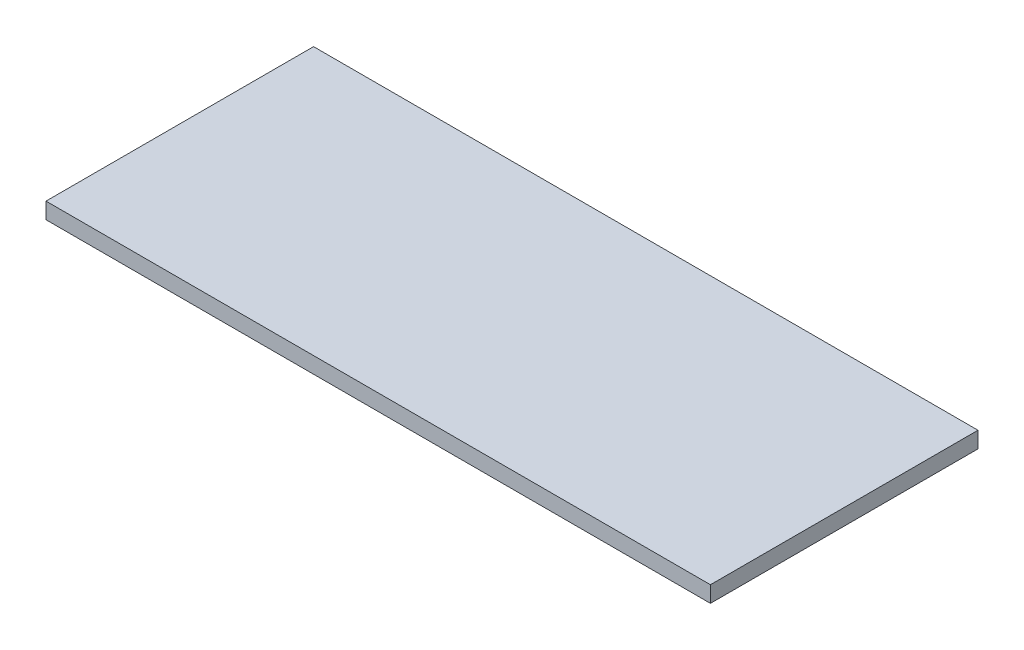
ISO-10303-21;
HEADER;
FILE_DESCRIPTION(('STEP AP214'),'2;1');
FILE_NAME('part.step','',(''),(''),'','','');
FILE_SCHEMA(('AUTOMOTIVE_DESIGN { 1 0 10303 214 1 1 1 1 }'));
ENDSEC;
DATA;
#1=APPLICATION_CONTEXT('core data for automotive mechanical design processes');
#2=APPLICATION_PROTOCOL_DEFINITION('international standard','automotive_design',2000,#1);
#3=PRODUCT_CONTEXT('',#1,'mechanical');
#4=PRODUCT('Part','Part','',(#3));
#5=PRODUCT_RELATED_PRODUCT_CATEGORY('part','',(#4));
#6=PRODUCT_DEFINITION_FORMATION('','',#4);
#7=PRODUCT_DEFINITION_CONTEXT('part definition',#1,'design');
#8=PRODUCT_DEFINITION('design','',#6,#7);
#9=PRODUCT_DEFINITION_SHAPE('','',#8);
#10=(LENGTH_UNIT() NAMED_UNIT(*) SI_UNIT(.MILLI.,.METRE.));
#11=(NAMED_UNIT(*) PLANE_ANGLE_UNIT() SI_UNIT($,.RADIAN.));
#12=(NAMED_UNIT(*) SI_UNIT($,.STERADIAN.) SOLID_ANGLE_UNIT());
#13=UNCERTAINTY_MEASURE_WITH_UNIT(LENGTH_MEASURE(1.E-05),#10,'distance_accuracy_value','');
#14=(GEOMETRIC_REPRESENTATION_CONTEXT(3) GLOBAL_UNCERTAINTY_ASSIGNED_CONTEXT((#13)) GLOBAL_UNIT_ASSIGNED_CONTEXT((#10,
#11,#12)) REPRESENTATION_CONTEXT('',''));
#15=CARTESIAN_POINT('',(0.,0.,0.));
#16=DIRECTION('',(0.,0.,1.));
#17=DIRECTION('',(1.,0.,0.));
#18=AXIS2_PLACEMENT_3D('',#15,#16,#17);
#19=CARTESIAN_POINT('',(-370.,18.,149.));
#20=DIRECTION('',(1.,0.,0.));
#21=DIRECTION('',(0.,0.,-1.));
#22=AXIS2_PLACEMENT_3D('',#19,#20,#21);
#23=PLANE('',#22);
#24=DIRECTION('',(0.,0.,1.));
#25=VECTOR('',#24,1.);
#26=CARTESIAN_POINT('',(-370.,0.,149.));
#27=LINE('',#26,#25);
#28=CARTESIAN_POINT('',(-370.,0.,-149.));
#29=VERTEX_POINT('',#28);
#30=CARTESIAN_POINT('',(-370.,0.,149.));
#31=VERTEX_POINT('',#30);
#32=EDGE_CURVE('E98',#29,#31,#27,.T.);
#33=ORIENTED_EDGE('',*,*,#32,.T.);
#34=DIRECTION('',(0.,-1.,0.));
#35=VECTOR('',#34,1.);
#36=CARTESIAN_POINT('',(-370.,18.,149.));
#37=LINE('',#36,#35);
#38=CARTESIAN_POINT('',(-370.,18.,149.));
#39=VERTEX_POINT('',#38);
#40=EDGE_CURVE('E11',#39,#31,#37,.T.);
#41=ORIENTED_EDGE('',*,*,#40,.F.);
#42=DIRECTION('',(0.,0.,1.));
#43=VECTOR('',#42,1.);
#44=CARTESIAN_POINT('',(-370.,18.,149.));
#45=LINE('',#44,#43);
#46=CARTESIAN_POINT('',(-370.,18.,-149.));
#47=VERTEX_POINT('',#46);
#48=EDGE_CURVE('E86',#47,#39,#45,.T.);
#49=ORIENTED_EDGE('',*,*,#48,.F.);
#50=DIRECTION('',(0.,-1.,0.));
#51=VECTOR('',#50,1.);
#52=CARTESIAN_POINT('',(-370.,18.,-149.));
#53=LINE('',#52,#51);
#54=EDGE_CURVE('E94',#47,#29,#53,.T.);
#55=ORIENTED_EDGE('',*,*,#54,.T.);
#56=EDGE_LOOP('',(#33,#41,#49,#55));
#57=FACE_BOUND('',#56,.T.);
#58=ADVANCED_FACE('F35',(#57),#23,.F.);
#59=CARTESIAN_POINT('',(370.,18.,149.));
#60=DIRECTION('',(0.,0.,-1.));
#61=DIRECTION('',(-1.,0.,0.));
#62=AXIS2_PLACEMENT_3D('',#59,#60,#61);
#63=PLANE('',#62);
#64=DIRECTION('',(1.,0.,0.));
#65=VECTOR('',#64,1.);
#66=CARTESIAN_POINT('',(370.,0.,149.));
#67=LINE('',#66,#65);
#68=CARTESIAN_POINT('',(370.,0.,149.));
#69=VERTEX_POINT('',#68);
#70=EDGE_CURVE('E90',#31,#69,#67,.T.);
#71=ORIENTED_EDGE('',*,*,#70,.T.);
#72=DIRECTION('',(0.,-1.,0.));
#73=VECTOR('',#72,1.);
#74=CARTESIAN_POINT('',(370.,18.,149.));
#75=LINE('',#74,#73);
#76=CARTESIAN_POINT('',(370.,18.,149.));
#77=VERTEX_POINT('',#76);
#78=EDGE_CURVE('E43',#77,#69,#75,.T.);
#79=ORIENTED_EDGE('',*,*,#78,.F.);
#80=DIRECTION('',(1.,0.,0.));
#81=VECTOR('',#80,1.);
#82=CARTESIAN_POINT('',(370.,18.,149.));
#83=LINE('',#82,#81);
#84=EDGE_CURVE('E81',#39,#77,#83,.T.);
#85=ORIENTED_EDGE('',*,*,#84,.F.);
#86=ORIENTED_EDGE('',*,*,#40,.T.);
#87=EDGE_LOOP('',(#71,#79,#85,#86));
#88=FACE_BOUND('',#87,.T.);
#89=ADVANCED_FACE('F89',(#88),#63,.F.);
#90=CARTESIAN_POINT('',(370.,18.,149.));
#91=DIRECTION('',(-1.,0.,0.));
#92=DIRECTION('',(0.,0.,1.));
#93=AXIS2_PLACEMENT_3D('',#90,#91,#92);
#94=PLANE('',#93);
#95=DIRECTION('',(0.,0.,-1.));
#96=VECTOR('',#95,1.);
#97=CARTESIAN_POINT('',(370.,0.,149.));
#98=LINE('',#97,#96);
#99=CARTESIAN_POINT('',(370.,0.,-149.));
#100=VERTEX_POINT('',#99);
#101=EDGE_CURVE('E68',#69,#100,#98,.T.);
#102=ORIENTED_EDGE('',*,*,#101,.T.);
#103=DIRECTION('',(0.,-1.,0.));
#104=VECTOR('',#103,1.);
#105=CARTESIAN_POINT('',(370.,18.,-149.));
#106=LINE('',#105,#104);
#107=CARTESIAN_POINT('',(370.,18.,-149.));
#108=VERTEX_POINT('',#107);
#109=EDGE_CURVE('E91',#108,#100,#106,.T.);
#110=ORIENTED_EDGE('',*,*,#109,.F.);
#111=DIRECTION('',(0.,0.,-1.));
#112=VECTOR('',#111,1.);
#113=CARTESIAN_POINT('',(370.,18.,149.));
#114=LINE('',#113,#112);
#115=EDGE_CURVE('E84',#77,#108,#114,.T.);
#116=ORIENTED_EDGE('',*,*,#115,.F.);
#117=ORIENTED_EDGE('',*,*,#78,.T.);
#118=EDGE_LOOP('',(#102,#110,#116,#117));
#119=FACE_BOUND('',#118,.T.);
#120=ADVANCED_FACE('F92',(#119),#94,.F.);
#121=CARTESIAN_POINT('',(370.,18.,-149.));
#122=DIRECTION('',(0.,0.,1.));
#123=DIRECTION('',(1.,0.,0.));
#124=AXIS2_PLACEMENT_3D('',#121,#122,#123);
#125=PLANE('',#124);
#126=DIRECTION('',(-1.,0.,0.));
#127=VECTOR('',#126,1.);
#128=CARTESIAN_POINT('',(370.,0.,-149.));
#129=LINE('',#128,#127);
#130=EDGE_CURVE('E74',#100,#29,#129,.T.);
#131=ORIENTED_EDGE('',*,*,#130,.T.);
#132=ORIENTED_EDGE('',*,*,#54,.F.);
#133=DIRECTION('',(-1.,0.,0.));
#134=VECTOR('',#133,1.);
#135=CARTESIAN_POINT('',(370.,18.,-149.));
#136=LINE('',#135,#134);
#137=EDGE_CURVE('E51',#108,#47,#136,.T.);
#138=ORIENTED_EDGE('',*,*,#137,.F.);
#139=ORIENTED_EDGE('',*,*,#109,.T.);
#140=EDGE_LOOP('',(#131,#132,#138,#139));
#141=FACE_BOUND('',#140,.T.);
#142=ADVANCED_FACE('F105',(#141),#125,.F.);
#143=CARTESIAN_POINT('',(0.,18.,0.));
#144=DIRECTION('',(0.,1.,0.));
#145=DIRECTION('',(0.,0.,1.));
#146=AXIS2_PLACEMENT_3D('',#143,#144,#145);
#147=PLANE('',#146);
#148=ORIENTED_EDGE('',*,*,#48,.T.);
#149=ORIENTED_EDGE('',*,*,#84,.T.);
#150=ORIENTED_EDGE('',*,*,#115,.T.);
#151=ORIENTED_EDGE('',*,*,#137,.T.);
#152=EDGE_LOOP('',(#148,#149,#150,#151));
#153=FACE_BOUND('',#152,.T.);
#154=ADVANCED_FACE('F82',(#153),#147,.T.);
#155=CARTESIAN_POINT('',(0.,0.,0.));
#156=DIRECTION('',(0.,1.,0.));
#157=DIRECTION('',(0.,0.,1.));
#158=AXIS2_PLACEMENT_3D('',#155,#156,#157);
#159=PLANE('',#158);
#160=ORIENTED_EDGE('',*,*,#32,.F.);
#161=ORIENTED_EDGE('',*,*,#130,.F.);
#162=ORIENTED_EDGE('',*,*,#101,.F.);
#163=ORIENTED_EDGE('',*,*,#70,.F.);
#164=EDGE_LOOP('',(#160,#161,#162,#163));
#165=FACE_BOUND('',#164,.T.);
#166=ADVANCED_FACE('F108',(#165),#159,.F.);
#167=CLOSED_SHELL('',(#58,#89,#120,#142,#154,#166));
#168=MANIFOLD_SOLID_BREP('B2',#167);
#169=ADVANCED_BREP_SHAPE_REPRESENTATION('',(#18,#168),#14);
#170=SHAPE_DEFINITION_REPRESENTATION(#9,#169);
ENDSEC;
END-ISO-10303-21;
